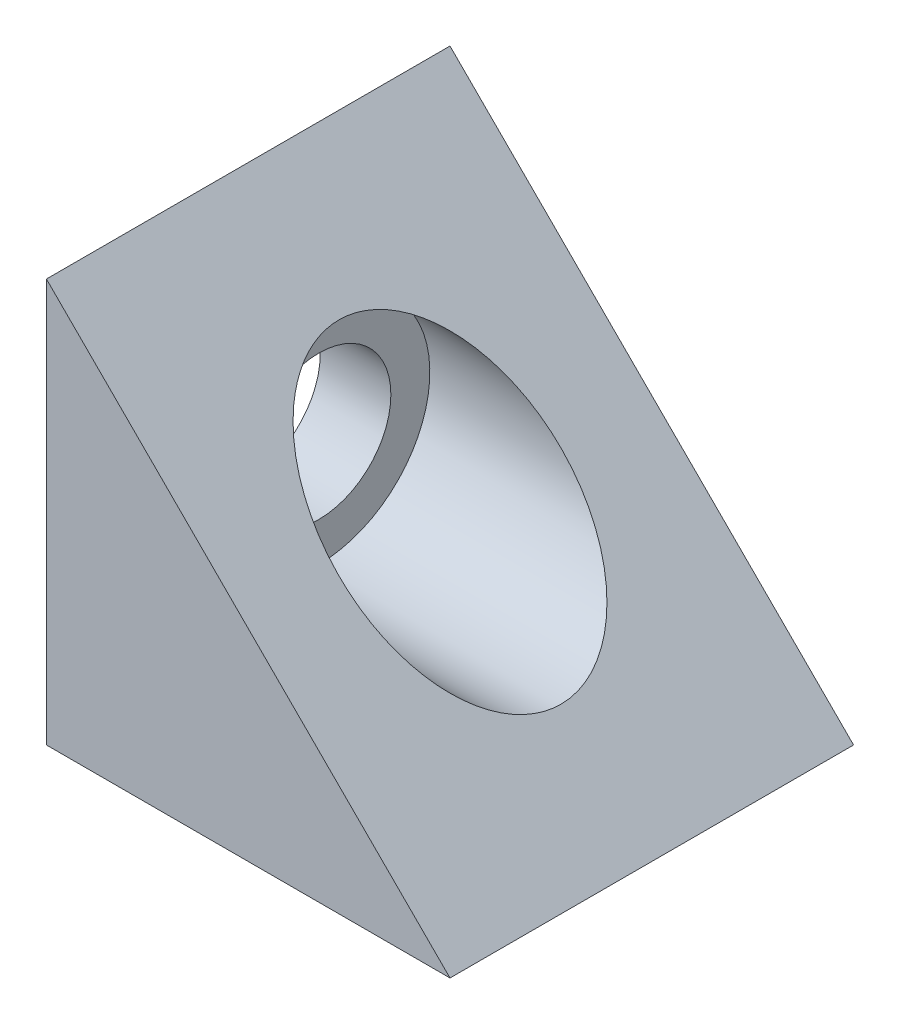
ISO-10303-21;
HEADER;
FILE_DESCRIPTION(('STEP AP214'),'2;1');
FILE_NAME('part.step','',(''),(''),'','','');
FILE_SCHEMA(('AUTOMOTIVE_DESIGN { 1 0 10303 214 1 1 1 1 }'));
ENDSEC;
DATA;
#1=APPLICATION_CONTEXT('core data for automotive mechanical design processes');
#2=APPLICATION_PROTOCOL_DEFINITION('international standard','automotive_design',2000,#1);
#3=PRODUCT_CONTEXT('',#1,'mechanical');
#4=PRODUCT('Part','Part','',(#3));
#5=PRODUCT_RELATED_PRODUCT_CATEGORY('part','',(#4));
#6=PRODUCT_DEFINITION_FORMATION('','',#4);
#7=PRODUCT_DEFINITION_CONTEXT('part definition',#1,'design');
#8=PRODUCT_DEFINITION('design','',#6,#7);
#9=PRODUCT_DEFINITION_SHAPE('','',#8);
#10=(LENGTH_UNIT() NAMED_UNIT(*) SI_UNIT(.MILLI.,.METRE.));
#11=(NAMED_UNIT(*) PLANE_ANGLE_UNIT() SI_UNIT($,.RADIAN.));
#12=(NAMED_UNIT(*) SI_UNIT($,.STERADIAN.) SOLID_ANGLE_UNIT());
#13=UNCERTAINTY_MEASURE_WITH_UNIT(LENGTH_MEASURE(1.E-05),#10,'distance_accuracy_value','');
#14=(GEOMETRIC_REPRESENTATION_CONTEXT(3) GLOBAL_UNCERTAINTY_ASSIGNED_CONTEXT((#13)) GLOBAL_UNIT_ASSIGNED_CONTEXT((#10,
#11,#12)) REPRESENTATION_CONTEXT('',''));
#15=CARTESIAN_POINT('',(0.,0.,0.));
#16=DIRECTION('',(0.,0.,1.));
#17=DIRECTION('',(1.,0.,0.));
#18=AXIS2_PLACEMENT_3D('',#15,#16,#17);
#19=CARTESIAN_POINT('',(20.,0.,-10.));
#20=DIRECTION('',(0.,-1.,0.));
#21=DIRECTION('',(1.,0.,0.));
#22=AXIS2_PLACEMENT_3D('',#19,#20,#21);
#23=PLANE('',#22);
#24=DIRECTION('',(1.,0.,0.));
#25=VECTOR('',#24,1.);
#26=CARTESIAN_POINT('',(20.,0.,10.));
#27=LINE('',#26,#25);
#28=CARTESIAN_POINT('',(0.,0.,10.));
#29=VERTEX_POINT('',#28);
#30=CARTESIAN_POINT('',(20.,0.,10.));
#31=VERTEX_POINT('',#30);
#32=EDGE_CURVE('E92',#29,#31,#27,.T.);
#33=ORIENTED_EDGE('',*,*,#32,.F.);
#34=DIRECTION('',(0.,0.,1.));
#35=VECTOR('',#34,1.);
#36=CARTESIAN_POINT('',(0.,0.,-10.));
#37=LINE('',#36,#35);
#38=CARTESIAN_POINT('',(0.,0.,-10.));
#39=VERTEX_POINT('',#38);
#40=EDGE_CURVE('E12',#39,#29,#37,.T.);
#41=ORIENTED_EDGE('',*,*,#40,.F.);
#42=DIRECTION('',(1.,0.,0.));
#43=VECTOR('',#42,1.);
#44=CARTESIAN_POINT('',(20.,0.,-10.));
#45=LINE('',#44,#43);
#46=CARTESIAN_POINT('',(20.,0.,-10.));
#47=VERTEX_POINT('',#46);
#48=EDGE_CURVE('E81',#39,#47,#45,.T.);
#49=ORIENTED_EDGE('',*,*,#48,.T.);
#50=DIRECTION('',(0.,0.,1.));
#51=VECTOR('',#50,1.);
#52=CARTESIAN_POINT('',(20.,0.,-10.));
#53=LINE('',#52,#51);
#54=EDGE_CURVE('E70',#47,#31,#53,.T.);
#55=ORIENTED_EDGE('',*,*,#54,.T.);
#56=EDGE_LOOP('',(#33,#41,#49,#55));
#57=FACE_BOUND('',#56,.T.);
#58=ADVANCED_FACE('F35',(#57),#23,.T.);
#59=CARTESIAN_POINT('',(0.,0.,-10.));
#60=DIRECTION('',(-1.,0.,0.));
#61=DIRECTION('',(0.,0.,1.));
#62=AXIS2_PLACEMENT_3D('',#59,#60,#61);
#63=PLANE('',#62);
#64=CARTESIAN_POINT('',(0.,10.,0.));
#65=DIRECTION('',(1.,0.,0.));
#66=DIRECTION('',(0.,0.,-1.));
#67=AXIS2_PLACEMENT_3D('',#64,#65,#66);
#68=CIRCLE('',#67,3.57);
#69=CARTESIAN_POINT('',(0.,10.,-3.57));
#70=VERTEX_POINT('',#69);
#71=EDGE_CURVE('E88',#70,#70,#68,.T.);
#72=ORIENTED_EDGE('',*,*,#71,.T.);
#73=EDGE_LOOP('',(#72));
#74=FACE_BOUND('',#73,.T.);
#75=DIRECTION('',(0.,-1.,0.));
#76=VECTOR('',#75,1.);
#77=CARTESIAN_POINT('',(0.,0.,10.));
#78=LINE('',#77,#76);
#79=CARTESIAN_POINT('',(0.,20.,10.));
#80=VERTEX_POINT('',#79);
#81=EDGE_CURVE('E83',#80,#29,#78,.T.);
#82=ORIENTED_EDGE('',*,*,#81,.F.);
#83=DIRECTION('',(0.,0.,1.));
#84=VECTOR('',#83,1.);
#85=CARTESIAN_POINT('',(0.,20.,-10.));
#86=LINE('',#85,#84);
#87=CARTESIAN_POINT('',(0.,20.,-10.));
#88=VERTEX_POINT('',#87);
#89=EDGE_CURVE('E44',#88,#80,#86,.T.);
#90=ORIENTED_EDGE('',*,*,#89,.F.);
#91=DIRECTION('',(0.,-1.,0.));
#92=VECTOR('',#91,1.);
#93=CARTESIAN_POINT('',(0.,0.,-10.));
#94=LINE('',#93,#92);
#95=EDGE_CURVE('E77',#88,#39,#94,.T.);
#96=ORIENTED_EDGE('',*,*,#95,.T.);
#97=ORIENTED_EDGE('',*,*,#40,.T.);
#98=EDGE_LOOP('',(#82,#90,#96,#97));
#99=FACE_BOUND('',#98,.T.);
#100=ADVANCED_FACE('F117',(#74,#99),#63,.T.);
#101=CARTESIAN_POINT('',(0.,20.,-10.));
#102=DIRECTION('',(0.707106781186548,0.707106781186548,0.));
#103=DIRECTION('',(-0.707106781186548,0.707106781186548,0.));
#104=AXIS2_PLACEMENT_3D('',#101,#102,#103);
#105=PLANE('',#104);
#106=CARTESIAN_POINT('',(10.,10.,0.));
#107=DIRECTION('',(0.707106781186548,0.707106781186548,0.));
#108=DIRECTION('',(0.707106781186548,-0.707106781186548,0.));
#109=AXIS2_PLACEMENT_3D('',#106,#107,#108);
#110=ELLIPSE('',#109,7.77817459305202,5.5);
#111=CARTESIAN_POINT('',(15.5,4.5,0.));
#112=VERTEX_POINT('',#111);
#113=EDGE_CURVE('E38',#112,#112,#110,.T.);
#114=ORIENTED_EDGE('',*,*,#113,.F.);
#115=EDGE_LOOP('',(#114));
#116=FACE_BOUND('',#115,.T.);
#117=DIRECTION('',(-0.707106781186548,0.707106781186548,0.));
#118=VECTOR('',#117,1.);
#119=CARTESIAN_POINT('',(0.,20.,10.));
#120=LINE('',#119,#118);
#121=EDGE_CURVE('E75',#31,#80,#120,.T.);
#122=ORIENTED_EDGE('',*,*,#121,.F.);
#123=ORIENTED_EDGE('',*,*,#54,.F.);
#124=DIRECTION('',(-0.707106781186548,0.707106781186548,0.));
#125=VECTOR('',#124,1.);
#126=CARTESIAN_POINT('',(0.,20.,-10.));
#127=LINE('',#126,#125);
#128=EDGE_CURVE('E73',#47,#88,#127,.T.);
#129=ORIENTED_EDGE('',*,*,#128,.T.);
#130=ORIENTED_EDGE('',*,*,#89,.T.);
#131=EDGE_LOOP('',(#122,#123,#129,#130));
#132=FACE_BOUND('',#131,.T.);
#133=ADVANCED_FACE('F72',(#116,#132),#105,.T.);
#134=CARTESIAN_POINT('',(0.,0.,-10.));
#135=DIRECTION('',(0.,0.,-1.));
#136=DIRECTION('',(-1.,0.,0.));
#137=AXIS2_PLACEMENT_3D('',#134,#135,#136);
#138=PLANE('',#137);
#139=ORIENTED_EDGE('',*,*,#48,.F.);
#140=ORIENTED_EDGE('',*,*,#95,.F.);
#141=ORIENTED_EDGE('',*,*,#128,.F.);
#142=EDGE_LOOP('',(#139,#140,#141));
#143=FACE_BOUND('',#142,.T.);
#144=ADVANCED_FACE('F80',(#143),#138,.T.);
#145=CARTESIAN_POINT('',(0.,0.,10.));
#146=DIRECTION('',(0.,0.,-1.));
#147=DIRECTION('',(-1.,0.,0.));
#148=AXIS2_PLACEMENT_3D('',#145,#146,#147);
#149=PLANE('',#148);
#150=ORIENTED_EDGE('',*,*,#32,.T.);
#151=ORIENTED_EDGE('',*,*,#121,.T.);
#152=ORIENTED_EDGE('',*,*,#81,.T.);
#153=EDGE_LOOP('',(#150,#151,#152));
#154=FACE_BOUND('',#153,.T.);
#155=ADVANCED_FACE('F129',(#154),#149,.F.);
#156=CARTESIAN_POINT('',(0.,10.,0.));
#157=DIRECTION('',(1.,0.,0.));
#158=DIRECTION('',(0.,0.,-1.));
#159=AXIS2_PLACEMENT_3D('',#156,#157,#158);
#160=CYLINDRICAL_SURFACE('',#159,3.57);
#161=CARTESIAN_POINT('',(3.5,10.,0.));
#162=DIRECTION('',(-1.,0.,0.));
#163=DIRECTION('',(0.,0.,1.));
#164=AXIS2_PLACEMENT_3D('',#161,#162,#163);
#165=CIRCLE('',#164,3.57);
#166=CARTESIAN_POINT('',(3.5,10.,3.57));
#167=VERTEX_POINT('',#166);
#168=EDGE_CURVE('E95',#167,#167,#165,.F.);
#169=ORIENTED_EDGE('',*,*,#168,.T.);
#170=EDGE_LOOP('',(#169));
#171=FACE_BOUND('',#170,.T.);
#172=ORIENTED_EDGE('',*,*,#71,.F.);
#173=EDGE_LOOP('',(#172));
#174=FACE_BOUND('',#173,.T.);
#175=ADVANCED_FACE('F114',(#171,#174),#160,.F.);
#176=CARTESIAN_POINT('',(3.5,0.,-10.));
#177=DIRECTION('',(-1.,0.,0.));
#178=DIRECTION('',(0.,0.,1.));
#179=AXIS2_PLACEMENT_3D('',#176,#177,#178);
#180=PLANE('',#179);
#181=CARTESIAN_POINT('',(3.5,10.,0.));
#182=DIRECTION('',(-1.,0.,0.));
#183=DIRECTION('',(0.,0.,1.));
#184=AXIS2_PLACEMENT_3D('',#181,#182,#183);
#185=CIRCLE('',#184,5.5);
#186=CARTESIAN_POINT('',(3.5,10.,5.5));
#187=VERTEX_POINT('',#186);
#188=EDGE_CURVE('E97',#187,#187,#185,.F.);
#189=ORIENTED_EDGE('',*,*,#188,.T.);
#190=EDGE_LOOP('',(#189));
#191=FACE_BOUND('',#190,.T.);
#192=ORIENTED_EDGE('',*,*,#168,.F.);
#193=EDGE_LOOP('',(#192));
#194=FACE_BOUND('',#193,.T.);
#195=ADVANCED_FACE('F104',(#191,#194),#180,.F.);
#196=CARTESIAN_POINT('',(-15.556349186104,10.,0.));
#197=DIRECTION('',(1.,0.,0.));
#198=DIRECTION('',(0.,0.,-1.));
#199=AXIS2_PLACEMENT_3D('',#196,#197,#198);
#200=CYLINDRICAL_SURFACE('',#199,5.5);
#201=ORIENTED_EDGE('',*,*,#113,.T.);
#202=EDGE_LOOP('',(#201));
#203=FACE_BOUND('',#202,.T.);
#204=ORIENTED_EDGE('',*,*,#188,.F.);
#205=EDGE_LOOP('',(#204));
#206=FACE_BOUND('',#205,.T.);
#207=ADVANCED_FACE('F107',(#203,#206),#200,.F.);
#208=CLOSED_SHELL('',(#58,#100,#133,#144,#155,#175,#195,#207));
#209=MANIFOLD_SOLID_BREP('B2',#208);
#210=ADVANCED_BREP_SHAPE_REPRESENTATION('',(#18,#209),#14);
#211=SHAPE_DEFINITION_REPRESENTATION(#9,#210);
ENDSEC;
END-ISO-10303-21;
